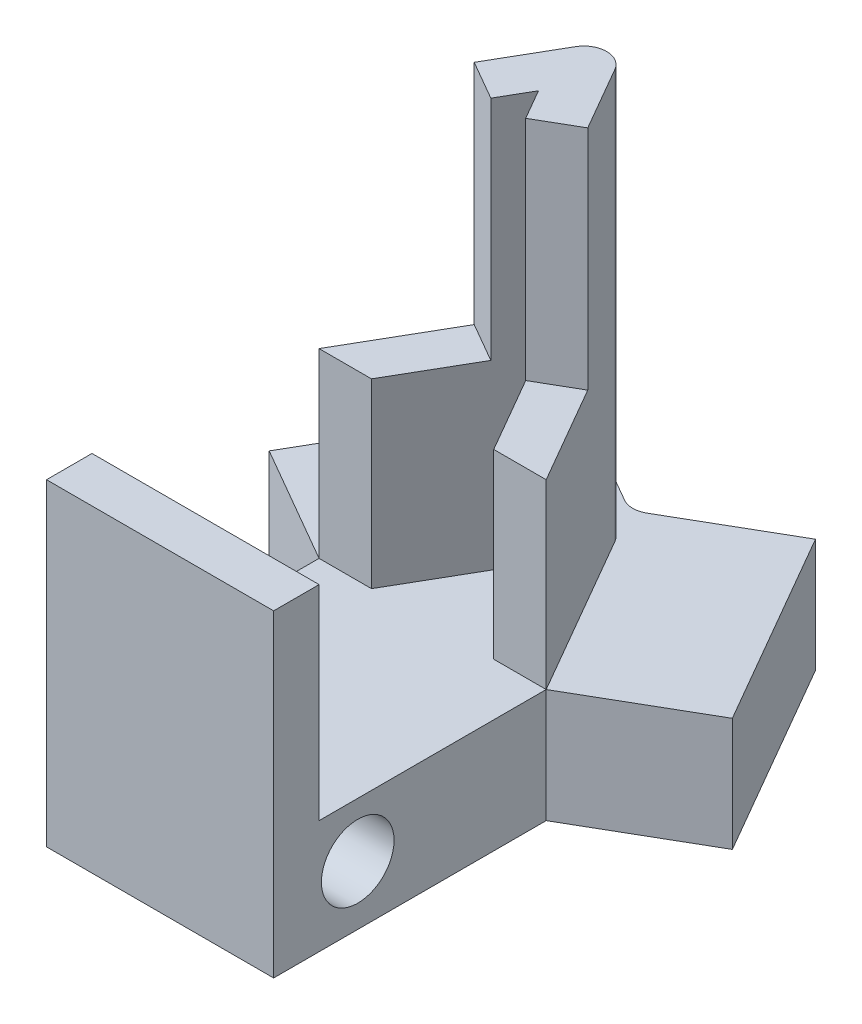
ISO-10303-21;
HEADER;
FILE_DESCRIPTION(('STEP AP214'),'2;1');
FILE_NAME('part.step','',(''),(''),'','','');
FILE_SCHEMA(('AUTOMOTIVE_DESIGN { 1 0 10303 214 1 1 1 1 }'));
ENDSEC;
DATA;
#1=APPLICATION_CONTEXT('core data for automotive mechanical design processes');
#2=APPLICATION_PROTOCOL_DEFINITION('international standard','automotive_design',2000,#1);
#3=PRODUCT_CONTEXT('',#1,'mechanical');
#4=PRODUCT('Part','Part','',(#3));
#5=PRODUCT_RELATED_PRODUCT_CATEGORY('part','',(#4));
#6=PRODUCT_DEFINITION_FORMATION('','',#4);
#7=PRODUCT_DEFINITION_CONTEXT('part definition',#1,'design');
#8=PRODUCT_DEFINITION('design','',#6,#7);
#9=PRODUCT_DEFINITION_SHAPE('','',#8);
#10=(LENGTH_UNIT() NAMED_UNIT(*) SI_UNIT(.MILLI.,.METRE.));
#11=(NAMED_UNIT(*) PLANE_ANGLE_UNIT() SI_UNIT($,.RADIAN.));
#12=(NAMED_UNIT(*) SI_UNIT($,.STERADIAN.) SOLID_ANGLE_UNIT());
#13=UNCERTAINTY_MEASURE_WITH_UNIT(LENGTH_MEASURE(1.E-05),#10,'distance_accuracy_value','');
#14=(GEOMETRIC_REPRESENTATION_CONTEXT(3) GLOBAL_UNCERTAINTY_ASSIGNED_CONTEXT((#13)) GLOBAL_UNIT_ASSIGNED_CONTEXT((#10,
#11,#12)) REPRESENTATION_CONTEXT('',''));
#15=CARTESIAN_POINT('',(0.,0.,0.));
#16=DIRECTION('',(0.,0.,1.));
#17=DIRECTION('',(1.,0.,0.));
#18=AXIS2_PLACEMENT_3D('',#15,#16,#17);
#19=CARTESIAN_POINT('',(-16.2819964313688,-3.,0.));
#20=DIRECTION('',(0.,0.,1.));
#21=DIRECTION('',(1.,0.,0.));
#22=AXIS2_PLACEMENT_3D('',#19,#20,#21);
#23=PLANE('',#22);
#24=DIRECTION('',(0.,-1.,0.));
#25=VECTOR('',#24,1.);
#26=CARTESIAN_POINT('',(-6.28199643136871,20.,0.));
#27=LINE('',#26,#25);
#28=CARTESIAN_POINT('',(-6.28199643136871,10.,0.));
#29=VERTEX_POINT('',#28);
#30=CARTESIAN_POINT('',(-6.28199643136871,2.,0.));
#31=VERTEX_POINT('',#30);
#32=EDGE_CURVE('E240',#29,#31,#27,.T.);
#33=ORIENTED_EDGE('',*,*,#32,.F.);
#34=DIRECTION('',(1.,0.,0.));
#35=VECTOR('',#34,1.);
#36=CARTESIAN_POINT('',(0.,10.,0.));
#37=LINE('',#36,#35);
#38=CARTESIAN_POINT('',(-8.59139750812723,10.,0.));
#39=VERTEX_POINT('',#38);
#40=EDGE_CURVE('E405',#39,#29,#37,.T.);
#41=ORIENTED_EDGE('',*,*,#40,.F.);
#42=DIRECTION('',(0.,-1.,0.));
#43=VECTOR('',#42,1.);
#44=CARTESIAN_POINT('',(-8.59139750812723,20.,0.));
#45=LINE('',#44,#43);
#46=CARTESIAN_POINT('',(-8.59139750812724,2.,0.));
#47=VERTEX_POINT('',#46);
#48=EDGE_CURVE('E242',#39,#47,#45,.T.);
#49=ORIENTED_EDGE('',*,*,#48,.T.);
#50=DIRECTION('',(-1.,0.,0.));
#51=VECTOR('',#50,1.);
#52=CARTESIAN_POINT('',(-16.2819964313688,2.,0.));
#53=LINE('',#52,#51);
#54=EDGE_CURVE('E376',#31,#47,#53,.T.);
#55=ORIENTED_EDGE('',*,*,#54,.F.);
#56=EDGE_LOOP('',(#33,#41,#49,#55));
#57=FACE_BOUND('',#56,.T.);
#58=ADVANCED_FACE('F34',(#57),#23,.T.);
#59=DIRECTION('',(0.,-1.,0.));
#60=VECTOR('',#59,1.);
#61=CARTESIAN_POINT('',(-13.9725953546103,20.,0.));
#62=LINE('',#61,#60);
#63=CARTESIAN_POINT('',(-13.9725953546103,10.,0.));
#64=VERTEX_POINT('',#63);
#65=CARTESIAN_POINT('',(-13.9725953546103,2.,0.));
#66=VERTEX_POINT('',#65);
#67=EDGE_CURVE('E235',#64,#66,#62,.T.);
#68=ORIENTED_EDGE('',*,*,#67,.F.);
#69=DIRECTION('',(1.,0.,0.));
#70=VECTOR('',#69,1.);
#71=CARTESIAN_POINT('',(0.,10.,0.));
#72=LINE('',#71,#70);
#73=CARTESIAN_POINT('',(-16.2819964313688,10.,0.));
#74=VERTEX_POINT('',#73);
#75=EDGE_CURVE('E417',#74,#64,#72,.T.);
#76=ORIENTED_EDGE('',*,*,#75,.F.);
#77=DIRECTION('',(0.,-1.,0.));
#78=VECTOR('',#77,1.);
#79=CARTESIAN_POINT('',(-16.2819964313688,20.,0.));
#80=LINE('',#79,#78);
#81=CARTESIAN_POINT('',(-16.2819964313688,2.,0.));
#82=VERTEX_POINT('',#81);
#83=EDGE_CURVE('E237',#74,#82,#80,.T.);
#84=ORIENTED_EDGE('',*,*,#83,.T.);
#85=EDGE_CURVE('E279',#66,#82,#53,.T.);
#86=ORIENTED_EDGE('',*,*,#85,.F.);
#87=EDGE_LOOP('',(#68,#76,#84,#86));
#88=FACE_BOUND('',#87,.T.);
#89=ADVANCED_FACE('F338',(#88),#23,.T.);
#90=CARTESIAN_POINT('',(-12.2114973235265,20.,-7.05031126694649));
#91=DIRECTION('',(0.866025403784437,0.,0.500000000000003));
#92=DIRECTION('',(0.500000000000003,0.,-0.866025403784437));
#93=AXIS2_PLACEMENT_3D('',#90,#91,#92);
#94=PLANE('',#93);
#95=DIRECTION('',(-0.500000000000003,0.,0.866025403784437));
#96=VECTOR('',#95,1.);
#97=CARTESIAN_POINT('',(-12.2114973235265,20.,-7.05031126694649));
#98=LINE('',#97,#96);
#99=CARTESIAN_POINT('',(-12.1480218351532,20.,-7.16025403784437));
#100=VERTEX_POINT('',#99);
#101=CARTESIAN_POINT('',(-13.7819964313688,20.,-4.33012701892217));
#102=VERTEX_POINT('',#101);
#103=EDGE_CURVE('E220',#100,#102,#98,.T.);
#104=ORIENTED_EDGE('',*,*,#103,.F.);
#105=DIRECTION('',(0.,-1.,0.));
#106=VECTOR('',#105,1.);
#107=CARTESIAN_POINT('',(-12.1480218351532,20.,-7.16025403784437));
#108=LINE('',#107,#106);
#109=CARTESIAN_POINT('',(-12.1480218351532,2.,-7.16025403784437));
#110=VERTEX_POINT('',#109);
#111=EDGE_CURVE('E293',#100,#110,#108,.T.);
#112=ORIENTED_EDGE('',*,*,#111,.T.);
#113=DIRECTION('',(-0.500000000000003,0.,0.866025403784437));
#114=VECTOR('',#113,1.);
#115=CARTESIAN_POINT('',(-12.2114973235265,2.,-7.05031126694649));
#116=LINE('',#115,#114);
#117=EDGE_CURVE('E229',#110,#82,#116,.T.);
#118=ORIENTED_EDGE('',*,*,#117,.T.);
#119=ORIENTED_EDGE('',*,*,#83,.F.);
#120=DIRECTION('',(-0.500000000000003,0.,0.866025403784437));
#121=VECTOR('',#120,1.);
#122=CARTESIAN_POINT('',(-12.2114973235265,10.,-7.05031126694649));
#123=LINE('',#122,#121);
#124=CARTESIAN_POINT('',(-13.7819964313688,10.,-4.33012701892217));
#125=VERTEX_POINT('',#124);
#126=EDGE_CURVE('E415',#125,#74,#123,.T.);
#127=ORIENTED_EDGE('',*,*,#126,.F.);
#128=DIRECTION('',(0.,1.,0.));
#129=VECTOR('',#128,1.);
#130=CARTESIAN_POINT('',(-13.7819964313688,10.,-4.33012701892217));
#131=LINE('',#130,#129);
#132=EDGE_CURVE('E422',#125,#102,#131,.T.);
#133=ORIENTED_EDGE('',*,*,#132,.T.);
#134=EDGE_LOOP('',(#104,#112,#118,#119,#127,#133));
#135=FACE_BOUND('',#134,.T.);
#136=ADVANCED_FACE('F344',(#135),#94,.F.);
#137=CARTESIAN_POINT('',(-10.4794465159577,20.,-6.05031126694648));
#138=DIRECTION('',(0.866025403784437,0.,0.500000000000002));
#139=DIRECTION('',(0.500000000000003,0.,-0.866025403784437));
#140=AXIS2_PLACEMENT_3D('',#137,#138,#139);
#141=PLANE('',#140);
#142=DIRECTION('',(-0.500000000000003,0.,0.866025403784437));
#143=VECTOR('',#142,1.);
#144=CARTESIAN_POINT('',(-10.4794465159577,20.,-6.05031126694648));
#145=LINE('',#144,#143);
#146=CARTESIAN_POINT('',(-11.2819964313687,20.,-4.66025403784438));
#147=VERTEX_POINT('',#146);
#148=CARTESIAN_POINT('',(-12.0499456237999,20.,-3.33012701892217));
#149=VERTEX_POINT('',#148);
#150=EDGE_CURVE('E222',#147,#149,#145,.T.);
#151=ORIENTED_EDGE('',*,*,#150,.T.);
#152=DIRECTION('',(0.,1.,0.));
#153=VECTOR('',#152,1.);
#154=CARTESIAN_POINT('',(-12.0499456237999,10.,-3.33012701892217));
#155=LINE('',#154,#153);
#156=CARTESIAN_POINT('',(-12.0499456237999,10.,-3.33012701892217));
#157=VERTEX_POINT('',#156);
#158=EDGE_CURVE('E425',#157,#149,#155,.T.);
#159=ORIENTED_EDGE('',*,*,#158,.F.);
#160=DIRECTION('',(0.500000000000003,0.,-0.866025403784437));
#161=VECTOR('',#160,1.);
#162=CARTESIAN_POINT('',(-10.4794465159577,10.,-6.05031126694648));
#163=LINE('',#162,#161);
#164=EDGE_CURVE('E419',#64,#157,#163,.T.);
#165=ORIENTED_EDGE('',*,*,#164,.F.);
#166=ORIENTED_EDGE('',*,*,#67,.T.);
#167=DIRECTION('',(-0.500000000000003,0.,0.866025403784437));
#168=VECTOR('',#167,1.);
#169=CARTESIAN_POINT('',(-10.4794465159577,2.,-6.05031126694648));
#170=LINE('',#169,#168);
#171=CARTESIAN_POINT('',(-11.2819964313687,2.,-4.66025403784438));
#172=VERTEX_POINT('',#171);
#173=EDGE_CURVE('E217',#172,#66,#170,.T.);
#174=ORIENTED_EDGE('',*,*,#173,.F.);
#175=DIRECTION('',(0.,-1.,0.));
#176=VECTOR('',#175,1.);
#177=CARTESIAN_POINT('',(-11.2819964313687,20.,-4.66025403784438));
#178=LINE('',#177,#176);
#179=EDGE_CURVE('E225',#147,#172,#178,.T.);
#180=ORIENTED_EDGE('',*,*,#179,.F.);
#181=EDGE_LOOP('',(#151,#159,#165,#166,#174,#180));
#182=FACE_BOUND('',#181,.T.);
#183=ADVANCED_FACE('F464',(#182),#141,.T.);
#184=CARTESIAN_POINT('',(0.,20.,0.));
#185=DIRECTION('',(0.,1.,0.));
#186=DIRECTION('',(0.,0.,1.));
#187=AXIS2_PLACEMENT_3D('',#184,#185,#186);
#188=PLANE('',#187);
#189=DIRECTION('',(-0.500000000000004,0.,-0.866025403784436));
#190=VECTOR('',#189,1.);
#191=CARTESIAN_POINT('',(-4.71149732352651,20.,2.72018424802426));
#192=LINE('',#191,#190);
#193=CARTESIAN_POINT('',(-8.78199643136873,20.,-4.33012701892218));
#194=VERTEX_POINT('',#193);
#195=CARTESIAN_POINT('',(-10.4159710275843,20.,-7.16025403784437));
#196=VERTEX_POINT('',#195);
#197=EDGE_CURVE('E216',#194,#196,#192,.T.);
#198=ORIENTED_EDGE('',*,*,#197,.T.);
#199=CARTESIAN_POINT('',(-11.2819964313687,20.,-6.66025403784436));
#200=DIRECTION('',(0.,1.,0.));
#201=DIRECTION('',(0.,0.,1.));
#202=AXIS2_PLACEMENT_3D('',#199,#200,#201);
#203=CIRCLE('',#202,1.);
#204=EDGE_CURVE('E298',#196,#100,#203,.T.);
#205=ORIENTED_EDGE('',*,*,#204,.T.);
#206=ORIENTED_EDGE('',*,*,#103,.T.);
#207=DIRECTION('',(0.866025403784437,0.,0.500000000000004));
#208=VECTOR('',#207,1.);
#209=CARTESIAN_POINT('',(-1.57049910784224,20.,2.72018424802432));
#210=LINE('',#209,#208);
#211=EDGE_CURVE('E411',#102,#149,#210,.T.);
#212=ORIENTED_EDGE('',*,*,#211,.T.);
#213=ORIENTED_EDGE('',*,*,#150,.F.);
#214=DIRECTION('',(-0.500000000000003,0.,-0.866025403784437));
#215=VECTOR('',#214,1.);
#216=CARTESIAN_POINT('',(-6.4435481310954,20.,3.72018424802427));
#217=LINE('',#216,#215);
#218=CARTESIAN_POINT('',(-10.5140472389376,20.,-3.33012701892216));
#219=VERTEX_POINT('',#218);
#220=EDGE_CURVE('E214',#219,#147,#217,.T.);
#221=ORIENTED_EDGE('',*,*,#220,.F.);
#222=DIRECTION('',(-0.866025403784436,0.,0.500000000000004));
#223=VECTOR('',#222,1.);
#224=CARTESIAN_POINT('',(-4.07049910784222,20.,-7.05031126694644));
#225=LINE('',#224,#223);
#226=EDGE_CURVE('E392',#194,#219,#225,.T.);
#227=ORIENTED_EDGE('',*,*,#226,.F.);
#228=EDGE_LOOP('',(#198,#205,#206,#212,#213,#221,#227));
#229=FACE_BOUND('',#228,.T.);
#230=ADVANCED_FACE('F455',(#229),#188,.T.);
#231=CARTESIAN_POINT('',(0.,2.,0.));
#232=DIRECTION('',(0.,-1.,0.));
#233=DIRECTION('',(0.,0.,-1.));
#234=AXIS2_PLACEMENT_3D('',#231,#232,#233);
#235=PLANE('',#234);
#236=DIRECTION('',(-1.,0.,0.));
#237=VECTOR('',#236,1.);
#238=CARTESIAN_POINT('',(-16.2819964313688,2.,9.9979872891056));
#239=LINE('',#238,#237);
#240=CARTESIAN_POINT('',(-6.28199643136867,2.,9.9979872891056));
#241=VERTEX_POINT('',#240);
#242=CARTESIAN_POINT('',(-16.2819964313688,2.,9.9979872891056));
#243=VERTEX_POINT('',#242);
#244=EDGE_CURVE('E427',#241,#243,#239,.T.);
#245=ORIENTED_EDGE('',*,*,#244,.F.);
#246=DIRECTION('',(0.,0.,-1.));
#247=VECTOR('',#246,1.);
#248=CARTESIAN_POINT('',(-6.28199643136866,2.,12.));
#249=LINE('',#248,#247);
#250=EDGE_CURVE('E378',#241,#31,#249,.T.);
#251=ORIENTED_EDGE('',*,*,#250,.T.);
#252=ORIENTED_EDGE('',*,*,#54,.T.);
#253=DIRECTION('',(-0.500000000000003,0.,-0.866025403784437));
#254=VECTOR('',#253,1.);
#255=CARTESIAN_POINT('',(-6.4435481310954,2.,3.72018424802427));
#256=LINE('',#255,#254);
#257=EDGE_CURVE('E208',#47,#172,#256,.T.);
#258=ORIENTED_EDGE('',*,*,#257,.T.);
#259=ORIENTED_EDGE('',*,*,#173,.T.);
#260=ORIENTED_EDGE('',*,*,#85,.T.);
#261=DIRECTION('',(0.,0.,1.));
#262=VECTOR('',#261,1.);
#263=CARTESIAN_POINT('',(-16.2819964313688,2.,0.));
#264=LINE('',#263,#262);
#265=EDGE_CURVE('E371',#82,#243,#264,.T.);
#266=ORIENTED_EDGE('',*,*,#265,.T.);
#267=EDGE_LOOP('',(#245,#251,#252,#258,#259,#260,#266));
#268=FACE_BOUND('',#267,.T.);
#269=ADVANCED_FACE('F362',(#268),#235,.F.);
#270=ORIENTED_EDGE('',*,*,#117,.F.);
#271=CARTESIAN_POINT('',(-11.2819964313687,2.,-6.66025403784436));
#272=DIRECTION('',(0.,-1.,0.));
#273=DIRECTION('',(0.,0.,-1.));
#274=AXIS2_PLACEMENT_3D('',#271,#272,#273);
#275=CIRCLE('',#274,1.);
#276=CARTESIAN_POINT('',(-10.4159710275843,2.,-7.16025403784437));
#277=VERTEX_POINT('',#276);
#278=EDGE_CURVE('E300',#110,#277,#275,.T.);
#279=ORIENTED_EDGE('',*,*,#278,.T.);
#280=DIRECTION('',(-0.500000000000004,0.,-0.866025403784436));
#281=VECTOR('',#280,1.);
#282=CARTESIAN_POINT('',(-4.71149732352651,2.,2.72018424802426));
#283=LINE('',#282,#281);
#284=EDGE_CURVE('E227',#31,#277,#283,.T.);
#285=ORIENTED_EDGE('',*,*,#284,.F.);
#286=DIRECTION('',(0.866025403784434,0.,-0.500000000000007));
#287=VECTOR('',#286,1.);
#288=CARTESIAN_POINT('',(-1.08584400866211,2.,-3.00000000000005));
#289=LINE('',#288,#287);
#290=CARTESIAN_POINT('',(-1.08584400866211,2.,-3.00000000000005));
#291=VERTEX_POINT('',#290);
#292=EDGE_CURVE('E247',#31,#291,#289,.T.);
#293=ORIENTED_EDGE('',*,*,#292,.T.);
#294=DIRECTION('',(-0.500000000000004,0.,-0.866025403784436));
#295=VECTOR('',#294,1.);
#296=CARTESIAN_POINT('',(-6.08584400866212,2.,-11.6602540378444));
#297=LINE('',#296,#295);
#298=CARTESIAN_POINT('',(-6.08584400866212,2.,-11.6602540378444));
#299=VERTEX_POINT('',#298);
#300=EDGE_CURVE('E250',#291,#299,#297,.T.);
#301=ORIENTED_EDGE('',*,*,#300,.T.);
#302=DIRECTION('',(-0.866025403784438,0.,0.500000000000001));
#303=VECTOR('',#302,1.);
#304=CARTESIAN_POINT('',(-11.2819964313687,2.,-8.66025403784435));
#305=LINE('',#304,#303);
#306=CARTESIAN_POINT('',(-10.7819964313687,2.,-8.94892917243916));
#307=VERTEX_POINT('',#306);
#308=EDGE_CURVE('E253',#299,#307,#305,.T.);
#309=ORIENTED_EDGE('',*,*,#308,.T.);
#310=CARTESIAN_POINT('',(-11.2819964313687,2.,-9.8149545762236));
#311=DIRECTION('',(0.,-1.,0.));
#312=DIRECTION('',(0.,0.,-1.));
#313=AXIS2_PLACEMENT_3D('',#310,#311,#312);
#314=CIRCLE('',#313,1.);
#315=CARTESIAN_POINT('',(-11.7819964313687,2.,-8.94892917243916));
#316=VERTEX_POINT('',#315);
#317=EDGE_CURVE('E42',#307,#316,#314,.T.);
#318=ORIENTED_EDGE('',*,*,#317,.T.);
#319=DIRECTION('',(-0.866025403784437,0.,-0.500000000000003));
#320=VECTOR('',#319,1.);
#321=CARTESIAN_POINT('',(-11.2819964313687,2.,-8.66025403784435));
#322=LINE('',#321,#320);
#323=CARTESIAN_POINT('',(-16.4781488540754,2.,-11.6602540378444));
#324=VERTEX_POINT('',#323);
#325=EDGE_CURVE('E255',#316,#324,#322,.T.);
#326=ORIENTED_EDGE('',*,*,#325,.T.);
#327=DIRECTION('',(-0.500000000000003,0.,0.866025403784437));
#328=VECTOR('',#327,1.);
#329=CARTESIAN_POINT('',(-16.4781488540754,2.,-11.6602540378444));
#330=LINE('',#329,#328);
#331=CARTESIAN_POINT('',(-21.4781488540754,2.,-2.99999999999998));
#332=VERTEX_POINT('',#331);
#333=EDGE_CURVE('E257',#324,#332,#330,.T.);
#334=ORIENTED_EDGE('',*,*,#333,.T.);
#335=DIRECTION('',(0.866025403784441,0.,0.499999999999997));
#336=VECTOR('',#335,1.);
#337=CARTESIAN_POINT('',(-21.4781488540754,2.,-2.99999999999998));
#338=LINE('',#337,#336);
#339=EDGE_CURVE('E244',#332,#82,#338,.T.);
#340=ORIENTED_EDGE('',*,*,#339,.T.);
#341=EDGE_LOOP('',(#270,#279,#285,#293,#301,#309,#318,#326,#334,#340));
#342=FACE_BOUND('',#341,.T.);
#343=ADVANCED_FACE('F314',(#342),#235,.F.);
#344=CARTESIAN_POINT('',(-21.4781488540754,-3.,-2.99999999999998));
#345=DIRECTION('',(-0.499999999999997,0.,0.86602540378444));
#346=DIRECTION('',(0.86602540378444,0.,0.499999999999997));
#347=AXIS2_PLACEMENT_3D('',#344,#345,#346);
#348=PLANE('',#347);
#349=DIRECTION('',(0.,1.,0.));
#350=VECTOR('',#349,1.);
#351=CARTESIAN_POINT('',(-16.2819964313688,-3.,0.));
#352=LINE('',#351,#350);
#353=CARTESIAN_POINT('',(-16.2819964313688,-3.,0.));
#354=VERTEX_POINT('',#353);
#355=EDGE_CURVE('E276',#354,#82,#352,.T.);
#356=ORIENTED_EDGE('',*,*,#355,.T.);
#357=ORIENTED_EDGE('',*,*,#339,.F.);
#358=DIRECTION('',(0.,1.,0.));
#359=VECTOR('',#358,1.);
#360=CARTESIAN_POINT('',(-21.4781488540754,-3.,-2.99999999999998));
#361=LINE('',#360,#359);
#362=CARTESIAN_POINT('',(-21.4781488540754,-3.,-2.99999999999998));
#363=VERTEX_POINT('',#362);
#364=EDGE_CURVE('E277',#363,#332,#361,.T.);
#365=ORIENTED_EDGE('',*,*,#364,.F.);
#366=DIRECTION('',(0.866025403784441,0.,0.499999999999997));
#367=VECTOR('',#366,1.);
#368=CARTESIAN_POINT('',(-21.4781488540754,-3.,-2.99999999999998));
#369=LINE('',#368,#367);
#370=EDGE_CURVE('E260',#363,#354,#369,.T.);
#371=ORIENTED_EDGE('',*,*,#370,.T.);
#372=EDGE_LOOP('',(#356,#357,#365,#371));
#373=FACE_BOUND('',#372,.T.);
#374=ADVANCED_FACE('F351',(#373),#348,.T.);
#375=CARTESIAN_POINT('',(-16.4781488540754,-3.,-11.6602540378444));
#376=DIRECTION('',(-0.866025403784437,0.,-0.500000000000003));
#377=DIRECTION('',(-0.500000000000003,0.,0.866025403784437));
#378=AXIS2_PLACEMENT_3D('',#375,#376,#377);
#379=PLANE('',#378);
#380=ORIENTED_EDGE('',*,*,#364,.T.);
#381=ORIENTED_EDGE('',*,*,#333,.F.);
#382=DIRECTION('',(0.,1.,0.));
#383=VECTOR('',#382,1.);
#384=CARTESIAN_POINT('',(-16.4781488540754,-3.,-11.6602540378444));
#385=LINE('',#384,#383);
#386=CARTESIAN_POINT('',(-16.4781488540754,-3.,-11.6602540378444));
#387=VERTEX_POINT('',#386);
#388=EDGE_CURVE('E280',#387,#324,#385,.T.);
#389=ORIENTED_EDGE('',*,*,#388,.F.);
#390=DIRECTION('',(-0.500000000000003,0.,0.866025403784437));
#391=VECTOR('',#390,1.);
#392=CARTESIAN_POINT('',(-16.4781488540754,-3.,-11.6602540378444));
#393=LINE('',#392,#391);
#394=EDGE_CURVE('E273',#387,#363,#393,.T.);
#395=ORIENTED_EDGE('',*,*,#394,.T.);
#396=EDGE_LOOP('',(#380,#381,#389,#395));
#397=FACE_BOUND('',#396,.T.);
#398=ADVANCED_FACE('F353',(#397),#379,.T.);
#399=CARTESIAN_POINT('',(-11.2819964313687,-3.,-8.66025403784435));
#400=DIRECTION('',(0.500000000000003,0.,-0.866025403784437));
#401=DIRECTION('',(-0.866025403784437,0.,-0.500000000000003));
#402=AXIS2_PLACEMENT_3D('',#399,#400,#401);
#403=PLANE('',#402);
#404=ORIENTED_EDGE('',*,*,#325,.F.);
#405=DIRECTION('',(0.,1.,0.));
#406=VECTOR('',#405,1.);
#407=CARTESIAN_POINT('',(-11.7819964313687,-3.,-8.94892917243916));
#408=LINE('',#407,#406);
#409=CARTESIAN_POINT('',(-11.7819964313687,-3.,-8.94892917243916));
#410=VERTEX_POINT('',#409);
#411=EDGE_CURVE('E49',#316,#410,#408,.F.);
#412=ORIENTED_EDGE('',*,*,#411,.T.);
#413=DIRECTION('',(-0.866025403784437,0.,-0.500000000000003));
#414=VECTOR('',#413,1.);
#415=CARTESIAN_POINT('',(-11.2819964313687,-3.,-8.66025403784435));
#416=LINE('',#415,#414);
#417=EDGE_CURVE('E271',#410,#387,#416,.T.);
#418=ORIENTED_EDGE('',*,*,#417,.T.);
#419=ORIENTED_EDGE('',*,*,#388,.T.);
#420=EDGE_LOOP('',(#404,#412,#418,#419));
#421=FACE_BOUND('',#420,.T.);
#422=ADVANCED_FACE('F359',(#421),#403,.T.);
#423=CARTESIAN_POINT('',(-11.2819964313687,-3.,-8.66025403784435));
#424=DIRECTION('',(-0.500000000000001,0.,-0.866025403784438));
#425=DIRECTION('',(-0.866025403784438,0.,0.500000000000001));
#426=AXIS2_PLACEMENT_3D('',#423,#424,#425);
#427=PLANE('',#426);
#428=DIRECTION('',(-0.866025403784438,0.,0.500000000000001));
#429=VECTOR('',#428,1.);
#430=CARTESIAN_POINT('',(-11.2819964313687,-3.,-8.66025403784435));
#431=LINE('',#430,#429);
#432=CARTESIAN_POINT('',(-6.08584400866212,-3.,-11.6602540378444));
#433=VERTEX_POINT('',#432);
#434=CARTESIAN_POINT('',(-10.7819964313687,-3.,-8.94892917243916));
#435=VERTEX_POINT('',#434);
#436=EDGE_CURVE('E268',#433,#435,#431,.T.);
#437=ORIENTED_EDGE('',*,*,#436,.T.);
#438=DIRECTION('',(0.,1.,0.));
#439=VECTOR('',#438,1.);
#440=CARTESIAN_POINT('',(-10.7819964313687,2.,-8.94892917243916));
#441=LINE('',#440,#439);
#442=EDGE_CURVE('E303',#435,#307,#441,.T.);
#443=ORIENTED_EDGE('',*,*,#442,.T.);
#444=ORIENTED_EDGE('',*,*,#308,.F.);
#445=DIRECTION('',(0.,1.,0.));
#446=VECTOR('',#445,1.);
#447=CARTESIAN_POINT('',(-6.08584400866212,-3.,-11.6602540378444));
#448=LINE('',#447,#446);
#449=EDGE_CURVE('E283',#433,#299,#448,.T.);
#450=ORIENTED_EDGE('',*,*,#449,.F.);
#451=EDGE_LOOP('',(#437,#443,#444,#450));
#452=FACE_BOUND('',#451,.T.);
#453=ADVANCED_FACE('F309',(#452),#427,.T.);
#454=CARTESIAN_POINT('',(-6.08584400866212,-3.,-11.6602540378444));
#455=DIRECTION('',(0.866025403784436,0.,-0.500000000000004));
#456=DIRECTION('',(-0.500000000000004,0.,-0.866025403784436));
#457=AXIS2_PLACEMENT_3D('',#454,#455,#456);
#458=PLANE('',#457);
#459=ORIENTED_EDGE('',*,*,#449,.T.);
#460=ORIENTED_EDGE('',*,*,#300,.F.);
#461=DIRECTION('',(0.,1.,0.));
#462=VECTOR('',#461,1.);
#463=CARTESIAN_POINT('',(-1.08584400866211,-3.,-3.00000000000005));
#464=LINE('',#463,#462);
#465=CARTESIAN_POINT('',(-1.08584400866211,-3.,-3.00000000000005));
#466=VERTEX_POINT('',#465);
#467=EDGE_CURVE('E285',#466,#291,#464,.T.);
#468=ORIENTED_EDGE('',*,*,#467,.F.);
#469=DIRECTION('',(-0.500000000000004,0.,-0.866025403784436));
#470=VECTOR('',#469,1.);
#471=CARTESIAN_POINT('',(-6.08584400866212,-3.,-11.6602540378444));
#472=LINE('',#471,#470);
#473=EDGE_CURVE('E265',#466,#433,#472,.T.);
#474=ORIENTED_EDGE('',*,*,#473,.T.);
#475=EDGE_LOOP('',(#459,#460,#468,#474));
#476=FACE_BOUND('',#475,.T.);
#477=ADVANCED_FACE('F319',(#476),#458,.T.);
#478=CARTESIAN_POINT('',(-1.08584400866211,-3.,-3.00000000000005));
#479=DIRECTION('',(0.500000000000008,0.,0.866025403784434));
#480=DIRECTION('',(0.866025403784434,0.,-0.500000000000008));
#481=AXIS2_PLACEMENT_3D('',#478,#479,#480);
#482=PLANE('',#481);
#483=ORIENTED_EDGE('',*,*,#467,.T.);
#484=ORIENTED_EDGE('',*,*,#292,.F.);
#485=DIRECTION('',(0.,1.,0.));
#486=VECTOR('',#485,1.);
#487=CARTESIAN_POINT('',(-6.28199643136871,-3.,0.));
#488=LINE('',#487,#486);
#489=CARTESIAN_POINT('',(-6.28199643136871,-3.,0.));
#490=VERTEX_POINT('',#489);
#491=EDGE_CURVE('E287',#490,#31,#488,.T.);
#492=ORIENTED_EDGE('',*,*,#491,.F.);
#493=DIRECTION('',(0.866025403784434,0.,-0.500000000000007));
#494=VECTOR('',#493,1.);
#495=CARTESIAN_POINT('',(-1.08584400866211,-3.,-3.00000000000005));
#496=LINE('',#495,#494);
#497=EDGE_CURVE('E262',#490,#466,#496,.T.);
#498=ORIENTED_EDGE('',*,*,#497,.T.);
#499=EDGE_LOOP('',(#483,#484,#492,#498));
#500=FACE_BOUND('',#499,.T.);
#501=ADVANCED_FACE('F349',(#500),#482,.T.);
#502=CARTESIAN_POINT('',(0.,-3.,0.));
#503=DIRECTION('',(0.,-1.,0.));
#504=DIRECTION('',(0.,0.,-1.));
#505=AXIS2_PLACEMENT_3D('',#502,#503,#504);
#506=PLANE('',#505);
#507=ORIENTED_EDGE('',*,*,#370,.F.);
#508=ORIENTED_EDGE('',*,*,#394,.F.);
#509=ORIENTED_EDGE('',*,*,#417,.F.);
#510=CARTESIAN_POINT('',(-11.2819964313687,-3.,-9.8149545762236));
#511=DIRECTION('',(0.,-1.,0.));
#512=DIRECTION('',(0.,0.,-1.));
#513=AXIS2_PLACEMENT_3D('',#510,#511,#512);
#514=CIRCLE('',#513,1.);
#515=EDGE_CURVE('E11',#410,#435,#514,.F.);
#516=ORIENTED_EDGE('',*,*,#515,.T.);
#517=ORIENTED_EDGE('',*,*,#436,.F.);
#518=ORIENTED_EDGE('',*,*,#473,.F.);
#519=ORIENTED_EDGE('',*,*,#497,.F.);
#520=DIRECTION('',(0.,0.,-1.));
#521=VECTOR('',#520,1.);
#522=CARTESIAN_POINT('',(-6.28199643136866,-3.,12.));
#523=LINE('',#522,#521);
#524=CARTESIAN_POINT('',(-6.28199643136866,-3.,12.));
#525=VERTEX_POINT('',#524);
#526=EDGE_CURVE('E206',#525,#490,#523,.T.);
#527=ORIENTED_EDGE('',*,*,#526,.F.);
#528=DIRECTION('',(1.,0.,0.));
#529=VECTOR('',#528,1.);
#530=CARTESIAN_POINT('',(-16.2819964313688,-3.,12.));
#531=LINE('',#530,#529);
#532=CARTESIAN_POINT('',(-16.2819964313688,-3.,12.));
#533=VERTEX_POINT('',#532);
#534=EDGE_CURVE('E211',#533,#525,#531,.T.);
#535=ORIENTED_EDGE('',*,*,#534,.F.);
#536=DIRECTION('',(0.,0.,1.));
#537=VECTOR('',#536,1.);
#538=CARTESIAN_POINT('',(-16.2819964313688,-3.,0.));
#539=LINE('',#538,#537);
#540=EDGE_CURVE('E205',#354,#533,#539,.T.);
#541=ORIENTED_EDGE('',*,*,#540,.F.);
#542=EDGE_LOOP('',(#507,#508,#509,#516,#517,#518,#519,#527,#535,#541));
#543=FACE_BOUND('',#542,.T.);
#544=ADVANCED_FACE('F323',(#543),#506,.T.);
#545=CARTESIAN_POINT('',(-6.4435481310954,20.,3.72018424802427));
#546=DIRECTION('',(-0.866025403784437,0.,0.500000000000002));
#547=DIRECTION('',(0.500000000000003,0.,0.866025403784437));
#548=AXIS2_PLACEMENT_3D('',#545,#546,#547);
#549=PLANE('',#548);
#550=DIRECTION('',(0.,1.,0.));
#551=VECTOR('',#550,1.);
#552=CARTESIAN_POINT('',(-10.5140472389376,10.,-3.33012701892216));
#553=LINE('',#552,#551);
#554=CARTESIAN_POINT('',(-10.5140472389376,10.,-3.33012701892216));
#555=VERTEX_POINT('',#554);
#556=EDGE_CURVE('E408',#555,#219,#553,.T.);
#557=ORIENTED_EDGE('',*,*,#556,.T.);
#558=ORIENTED_EDGE('',*,*,#220,.T.);
#559=ORIENTED_EDGE('',*,*,#179,.T.);
#560=ORIENTED_EDGE('',*,*,#257,.F.);
#561=ORIENTED_EDGE('',*,*,#48,.F.);
#562=DIRECTION('',(0.500000000000003,0.,0.866025403784437));
#563=VECTOR('',#562,1.);
#564=CARTESIAN_POINT('',(-6.44354813109541,10.,3.72018424802427));
#565=LINE('',#564,#563);
#566=EDGE_CURVE('E403',#555,#39,#565,.T.);
#567=ORIENTED_EDGE('',*,*,#566,.F.);
#568=EDGE_LOOP('',(#557,#558,#559,#560,#561,#567));
#569=FACE_BOUND('',#568,.T.);
#570=ADVANCED_FACE('F445',(#569),#549,.T.);
#571=CARTESIAN_POINT('',(-4.71149732352651,20.,2.72018424802426));
#572=DIRECTION('',(-0.866025403784436,0.,0.500000000000004));
#573=DIRECTION('',(0.500000000000004,0.,0.866025403784436));
#574=AXIS2_PLACEMENT_3D('',#571,#572,#573);
#575=PLANE('',#574);
#576=ORIENTED_EDGE('',*,*,#284,.T.);
#577=DIRECTION('',(0.,-1.,0.));
#578=VECTOR('',#577,1.);
#579=CARTESIAN_POINT('',(-10.4159710275843,20.,-7.16025403784437));
#580=LINE('',#579,#578);
#581=EDGE_CURVE('E296',#277,#196,#580,.F.);
#582=ORIENTED_EDGE('',*,*,#581,.T.);
#583=ORIENTED_EDGE('',*,*,#197,.F.);
#584=DIRECTION('',(0.,1.,0.));
#585=VECTOR('',#584,1.);
#586=CARTESIAN_POINT('',(-8.78199643136873,10.,-4.33012701892218));
#587=LINE('',#586,#585);
#588=CARTESIAN_POINT('',(-8.78199643136873,10.,-4.33012701892218));
#589=VERTEX_POINT('',#588);
#590=EDGE_CURVE('E406',#589,#194,#587,.T.);
#591=ORIENTED_EDGE('',*,*,#590,.F.);
#592=DIRECTION('',(-0.500000000000004,0.,-0.866025403784436));
#593=VECTOR('',#592,1.);
#594=CARTESIAN_POINT('',(-4.71149732352651,10.,2.72018424802426));
#595=LINE('',#594,#593);
#596=EDGE_CURVE('E394',#29,#589,#595,.T.);
#597=ORIENTED_EDGE('',*,*,#596,.F.);
#598=ORIENTED_EDGE('',*,*,#32,.T.);
#599=EDGE_LOOP('',(#576,#582,#583,#591,#597,#598));
#600=FACE_BOUND('',#599,.T.);
#601=ADVANCED_FACE('F458',(#600),#575,.F.);
#602=CARTESIAN_POINT('',(-6.28199643136866,-3.,12.));
#603=DIRECTION('',(1.,0.,0.));
#604=DIRECTION('',(0.,0.,-1.));
#605=AXIS2_PLACEMENT_3D('',#602,#603,#604);
#606=PLANE('',#605);
#607=CARTESIAN_POINT('',(-6.28199643136868,-0.4,8.29856453989521));
#608=DIRECTION('',(1.,0.,0.));
#609=DIRECTION('',(0.,0.,-1.));
#610=AXIS2_PLACEMENT_3D('',#607,#608,#609);
#611=CIRCLE('',#610,1.6);
#612=CARTESIAN_POINT('',(-6.28199643136868,-0.4,6.69856453989521));
#613=VERTEX_POINT('',#612);
#614=EDGE_CURVE('E505',#613,#613,#611,.T.);
#615=ORIENTED_EDGE('',*,*,#614,.F.);
#616=EDGE_LOOP('',(#615));
#617=FACE_BOUND('',#616,.T.);
#618=DIRECTION('',(0.,0.,1.));
#619=VECTOR('',#618,1.);
#620=CARTESIAN_POINT('',(-6.28199643136866,11.,9.));
#621=LINE('',#620,#619);
#622=CARTESIAN_POINT('',(-6.28199643136867,11.,9.9979872891056));
#623=VERTEX_POINT('',#622);
#624=CARTESIAN_POINT('',(-6.28199643136866,11.,12.));
#625=VERTEX_POINT('',#624);
#626=EDGE_CURVE('E190',#623,#625,#621,.T.);
#627=ORIENTED_EDGE('',*,*,#626,.T.);
#628=DIRECTION('',(0.,1.,0.));
#629=VECTOR('',#628,1.);
#630=CARTESIAN_POINT('',(-6.28199643136866,-3.,12.));
#631=LINE('',#630,#629);
#632=EDGE_CURVE('E198',#525,#625,#631,.T.);
#633=ORIENTED_EDGE('',*,*,#632,.F.);
#634=ORIENTED_EDGE('',*,*,#526,.T.);
#635=ORIENTED_EDGE('',*,*,#491,.T.);
#636=ORIENTED_EDGE('',*,*,#250,.F.);
#637=DIRECTION('',(0.,-1.,0.));
#638=VECTOR('',#637,1.);
#639=CARTESIAN_POINT('',(-6.28199643136867,20.,9.9979872891056));
#640=LINE('',#639,#638);
#641=EDGE_CURVE('E383',#623,#241,#640,.T.);
#642=ORIENTED_EDGE('',*,*,#641,.F.);
#643=EDGE_LOOP('',(#627,#633,#634,#635,#636,#642));
#644=FACE_BOUND('',#643,.T.);
#645=ADVANCED_FACE('F389',(#617,#644),#606,.T.);
#646=CARTESIAN_POINT('',(-16.2819964313688,-3.,12.));
#647=DIRECTION('',(0.,0.,1.));
#648=DIRECTION('',(1.,0.,0.));
#649=AXIS2_PLACEMENT_3D('',#646,#647,#648);
#650=PLANE('',#649);
#651=DIRECTION('',(1.,0.,0.));
#652=VECTOR('',#651,1.);
#653=CARTESIAN_POINT('',(-16.2819964313688,11.,12.));
#654=LINE('',#653,#652);
#655=CARTESIAN_POINT('',(-16.2819964313688,11.,12.));
#656=VERTEX_POINT('',#655);
#657=EDGE_CURVE('E183',#656,#625,#654,.T.);
#658=ORIENTED_EDGE('',*,*,#657,.F.);
#659=DIRECTION('',(0.,1.,0.));
#660=VECTOR('',#659,1.);
#661=CARTESIAN_POINT('',(-16.2819964313688,-3.,12.));
#662=LINE('',#661,#660);
#663=EDGE_CURVE('E196',#533,#656,#662,.T.);
#664=ORIENTED_EDGE('',*,*,#663,.F.);
#665=ORIENTED_EDGE('',*,*,#534,.T.);
#666=ORIENTED_EDGE('',*,*,#632,.T.);
#667=EDGE_LOOP('',(#658,#664,#665,#666));
#668=FACE_BOUND('',#667,.T.);
#669=ADVANCED_FACE('F194',(#668),#650,.T.);
#670=CARTESIAN_POINT('',(-16.2819964313688,-3.,0.));
#671=DIRECTION('',(-1.,0.,0.));
#672=DIRECTION('',(0.,0.,1.));
#673=AXIS2_PLACEMENT_3D('',#670,#671,#672);
#674=PLANE('',#673);
#675=DIRECTION('',(0.,0.,1.));
#676=VECTOR('',#675,1.);
#677=CARTESIAN_POINT('',(-16.2819964313688,11.,9.));
#678=LINE('',#677,#676);
#679=CARTESIAN_POINT('',(-16.2819964313688,11.,9.9979872891056));
#680=VERTEX_POINT('',#679);
#681=EDGE_CURVE('E180',#680,#656,#678,.T.);
#682=ORIENTED_EDGE('',*,*,#681,.F.);
#683=DIRECTION('',(0.,-1.,0.));
#684=VECTOR('',#683,1.);
#685=CARTESIAN_POINT('',(-16.2819964313688,20.,9.9979872891056));
#686=LINE('',#685,#684);
#687=EDGE_CURVE('E377',#680,#243,#686,.T.);
#688=ORIENTED_EDGE('',*,*,#687,.T.);
#689=ORIENTED_EDGE('',*,*,#265,.F.);
#690=ORIENTED_EDGE('',*,*,#355,.F.);
#691=ORIENTED_EDGE('',*,*,#540,.T.);
#692=ORIENTED_EDGE('',*,*,#663,.T.);
#693=EDGE_LOOP('',(#682,#688,#689,#690,#691,#692));
#694=FACE_BOUND('',#693,.T.);
#695=ADVANCED_FACE('F202',(#694),#674,.T.);
#696=CARTESIAN_POINT('',(-16.2819964313688,20.,9.9979872891056));
#697=DIRECTION('',(0.,0.,1.));
#698=DIRECTION('',(1.,0.,0.));
#699=AXIS2_PLACEMENT_3D('',#696,#697,#698);
#700=PLANE('',#699);
#701=ORIENTED_EDGE('',*,*,#687,.F.);
#702=DIRECTION('',(1.,0.,0.));
#703=VECTOR('',#702,1.);
#704=CARTESIAN_POINT('',(-16.2819964313688,11.,9.9979872891056));
#705=LINE('',#704,#703);
#706=EDGE_CURVE('E186',#680,#623,#705,.T.);
#707=ORIENTED_EDGE('',*,*,#706,.T.);
#708=ORIENTED_EDGE('',*,*,#641,.T.);
#709=ORIENTED_EDGE('',*,*,#244,.T.);
#710=EDGE_LOOP('',(#701,#707,#708,#709));
#711=FACE_BOUND('',#710,.T.);
#712=ADVANCED_FACE('F432',(#711),#700,.F.);
#713=CARTESIAN_POINT('',(-1.57049910784224,10.,2.72018424802432));
#714=DIRECTION('',(-0.500000000000004,0.,0.866025403784437));
#715=DIRECTION('',(0.866025403784437,0.,0.500000000000004));
#716=AXIS2_PLACEMENT_3D('',#713,#714,#715);
#717=PLANE('',#716);
#718=ORIENTED_EDGE('',*,*,#211,.F.);
#719=ORIENTED_EDGE('',*,*,#132,.F.);
#720=DIRECTION('',(0.866025403784437,0.,0.500000000000004));
#721=VECTOR('',#720,1.);
#722=CARTESIAN_POINT('',(-1.57049910784224,10.,2.72018424802432));
#723=LINE('',#722,#721);
#724=EDGE_CURVE('E413',#125,#157,#723,.T.);
#725=ORIENTED_EDGE('',*,*,#724,.T.);
#726=ORIENTED_EDGE('',*,*,#158,.T.);
#727=EDGE_LOOP('',(#718,#719,#725,#726));
#728=FACE_BOUND('',#727,.T.);
#729=ADVANCED_FACE('F481',(#728),#717,.T.);
#730=CARTESIAN_POINT('',(0.,10.,0.));
#731=DIRECTION('',(0.,1.,0.));
#732=DIRECTION('',(0.,0.,1.));
#733=AXIS2_PLACEMENT_3D('',#730,#731,#732);
#734=PLANE('',#733);
#735=ORIENTED_EDGE('',*,*,#724,.F.);
#736=ORIENTED_EDGE('',*,*,#126,.T.);
#737=ORIENTED_EDGE('',*,*,#75,.T.);
#738=ORIENTED_EDGE('',*,*,#164,.T.);
#739=EDGE_LOOP('',(#735,#736,#737,#738));
#740=FACE_BOUND('',#739,.T.);
#741=ADVANCED_FACE('F484',(#740),#734,.T.);
#742=CARTESIAN_POINT('',(-4.07049910784222,10.,-7.05031126694644));
#743=DIRECTION('',(-0.500000000000004,0.,-0.866025403784436));
#744=DIRECTION('',(-0.866025403784436,0.,0.500000000000004));
#745=AXIS2_PLACEMENT_3D('',#742,#743,#744);
#746=PLANE('',#745);
#747=ORIENTED_EDGE('',*,*,#226,.T.);
#748=ORIENTED_EDGE('',*,*,#556,.F.);
#749=DIRECTION('',(-0.866025403784436,0.,0.500000000000004));
#750=VECTOR('',#749,1.);
#751=CARTESIAN_POINT('',(-4.07049910784222,10.,-7.05031126694644));
#752=LINE('',#751,#750);
#753=EDGE_CURVE('E400',#589,#555,#752,.T.);
#754=ORIENTED_EDGE('',*,*,#753,.F.);
#755=ORIENTED_EDGE('',*,*,#590,.T.);
#756=EDGE_LOOP('',(#747,#748,#754,#755));
#757=FACE_BOUND('',#756,.T.);
#758=ADVANCED_FACE('F488',(#757),#746,.F.);
#759=CARTESIAN_POINT('',(0.,10.,0.));
#760=DIRECTION('',(0.,1.,0.));
#761=DIRECTION('',(0.,0.,1.));
#762=AXIS2_PLACEMENT_3D('',#759,#760,#761);
#763=PLANE('',#762);
#764=ORIENTED_EDGE('',*,*,#596,.T.);
#765=ORIENTED_EDGE('',*,*,#753,.T.);
#766=ORIENTED_EDGE('',*,*,#566,.T.);
#767=ORIENTED_EDGE('',*,*,#40,.T.);
#768=EDGE_LOOP('',(#764,#765,#766,#767));
#769=FACE_BOUND('',#768,.T.);
#770=ADVANCED_FACE('F492',(#769),#763,.T.);
#771=CARTESIAN_POINT('',(-16.2819964313688,11.,9.));
#772=DIRECTION('',(0.,-1.,0.));
#773=DIRECTION('',(0.,0.,-1.));
#774=AXIS2_PLACEMENT_3D('',#771,#772,#773);
#775=PLANE('',#774);
#776=ORIENTED_EDGE('',*,*,#681,.T.);
#777=ORIENTED_EDGE('',*,*,#657,.T.);
#778=ORIENTED_EDGE('',*,*,#626,.F.);
#779=ORIENTED_EDGE('',*,*,#706,.F.);
#780=EDGE_LOOP('',(#776,#777,#778,#779));
#781=FACE_BOUND('',#780,.T.);
#782=ADVANCED_FACE('F182',(#781),#775,.F.);
#783=CARTESIAN_POINT('',(-11.2819964313687,20.,-6.66025403784436));
#784=DIRECTION('',(0.,-1.,0.));
#785=DIRECTION('',(0.,0.,-1.));
#786=AXIS2_PLACEMENT_3D('',#783,#784,#785);
#787=CYLINDRICAL_SURFACE('',#786,1.);
#788=ORIENTED_EDGE('',*,*,#204,.F.);
#789=ORIENTED_EDGE('',*,*,#581,.F.);
#790=ORIENTED_EDGE('',*,*,#278,.F.);
#791=ORIENTED_EDGE('',*,*,#111,.F.);
#792=EDGE_LOOP('',(#788,#789,#790,#791));
#793=FACE_BOUND('',#792,.T.);
#794=ADVANCED_FACE('F328',(#793),#787,.T.);
#795=CARTESIAN_POINT('',(-11.2819964313687,-3.,-9.8149545762236));
#796=DIRECTION('',(0.,-1.,0.));
#797=DIRECTION('',(0.,0.,-1.));
#798=AXIS2_PLACEMENT_3D('',#795,#796,#797);
#799=CYLINDRICAL_SURFACE('',#798,1.);
#800=ORIENTED_EDGE('',*,*,#515,.F.);
#801=ORIENTED_EDGE('',*,*,#411,.F.);
#802=ORIENTED_EDGE('',*,*,#317,.F.);
#803=ORIENTED_EDGE('',*,*,#442,.F.);
#804=EDGE_LOOP('',(#800,#801,#802,#803));
#805=FACE_BOUND('',#804,.T.);
#806=ADVANCED_FACE('F36',(#805),#799,.F.);
#807=CARTESIAN_POINT('',(-9.28199643136868,-0.4,8.29856453989523));
#808=DIRECTION('',(1.,0.,0.));
#809=DIRECTION('',(0.,0.,-1.));
#810=AXIS2_PLACEMENT_3D('',#807,#808,#809);
#811=CYLINDRICAL_SURFACE('',#810,1.6);
#812=CARTESIAN_POINT('',(-9.28199643136868,-0.4,8.29856453989523));
#813=DIRECTION('',(1.,0.,0.));
#814=DIRECTION('',(0.,0.,-1.));
#815=AXIS2_PLACEMENT_3D('',#812,#813,#814);
#816=CIRCLE('',#815,1.6);
#817=CARTESIAN_POINT('',(-9.28199643136868,-0.4,6.69856453989523));
#818=VERTEX_POINT('',#817);
#819=EDGE_CURVE('E199',#818,#818,#816,.T.);
#820=ORIENTED_EDGE('',*,*,#819,.F.);
#821=EDGE_LOOP('',(#820));
#822=FACE_BOUND('',#821,.T.);
#823=ORIENTED_EDGE('',*,*,#614,.T.);
#824=EDGE_LOOP('',(#823));
#825=FACE_BOUND('',#824,.T.);
#826=ADVANCED_FACE('F327',(#822,#825),#811,.F.);
#827=CARTESIAN_POINT('',(-9.28199643136868,-0.4,8.29856453989523));
#828=DIRECTION('',(1.,0.,0.));
#829=DIRECTION('',(0.,0.,-1.));
#830=AXIS2_PLACEMENT_3D('',#827,#828,#829);
#831=PLANE('',#830);
#832=ORIENTED_EDGE('',*,*,#819,.T.);
#833=EDGE_LOOP('',(#832));
#834=FACE_BOUND('',#833,.T.);
#835=ADVANCED_FACE('F333',(#834),#831,.T.);
#836=CLOSED_SHELL('',(#58,#89,#136,#183,#230,#269,#343,#374,#398,#422,#453,#477,#501,#544,#570,
#601,#645,#669,#695,#712,#729,#741,#758,#770,#782,#794,#806,#826,#835));
#837=MANIFOLD_SOLID_BREP('B2',#836);
#838=ADVANCED_BREP_SHAPE_REPRESENTATION('',(#18,#837),#14);
#839=SHAPE_DEFINITION_REPRESENTATION(#9,#838);
ENDSEC;
END-ISO-10303-21;
